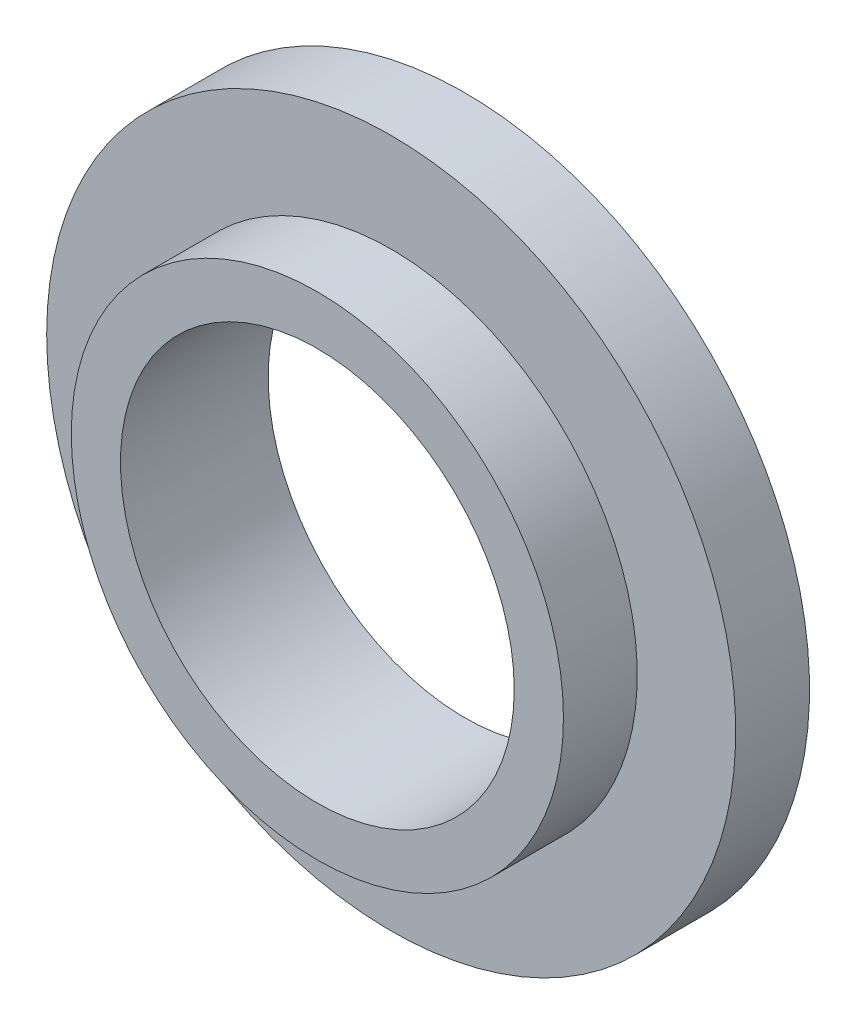
ISO-10303-21;
HEADER;
FILE_DESCRIPTION(('STEP AP214'),'2;1');
FILE_NAME('part.step','',(''),(''),'','','');
FILE_SCHEMA(('AUTOMOTIVE_DESIGN { 1 0 10303 214 1 1 1 1 }'));
ENDSEC;
DATA;
#1=APPLICATION_CONTEXT('core data for automotive mechanical design processes');
#2=APPLICATION_PROTOCOL_DEFINITION('international standard','automotive_design',2000,#1);
#3=PRODUCT_CONTEXT('',#1,'mechanical');
#4=PRODUCT('Part','Part','',(#3));
#5=PRODUCT_RELATED_PRODUCT_CATEGORY('part','',(#4));
#6=PRODUCT_DEFINITION_FORMATION('','',#4);
#7=PRODUCT_DEFINITION_CONTEXT('part definition',#1,'design');
#8=PRODUCT_DEFINITION('design','',#6,#7);
#9=PRODUCT_DEFINITION_SHAPE('','',#8);
#10=(LENGTH_UNIT() NAMED_UNIT(*) SI_UNIT(.MILLI.,.METRE.));
#11=(NAMED_UNIT(*) PLANE_ANGLE_UNIT() SI_UNIT($,.RADIAN.));
#12=(NAMED_UNIT(*) SI_UNIT($,.STERADIAN.) SOLID_ANGLE_UNIT());
#13=UNCERTAINTY_MEASURE_WITH_UNIT(LENGTH_MEASURE(1.E-05),#10,'distance_accuracy_value','');
#14=(GEOMETRIC_REPRESENTATION_CONTEXT(3) GLOBAL_UNCERTAINTY_ASSIGNED_CONTEXT((#13)) GLOBAL_UNIT_ASSIGNED_CONTEXT((#10,
#11,#12)) REPRESENTATION_CONTEXT('',''));
#15=CARTESIAN_POINT('',(0.,0.,0.));
#16=DIRECTION('',(0.,0.,1.));
#17=DIRECTION('',(1.,0.,0.));
#18=AXIS2_PLACEMENT_3D('',#15,#16,#17);
#19=CARTESIAN_POINT('',(0.,0.,15.));
#20=DIRECTION('',(0.,0.,-1.));
#21=DIRECTION('',(-1.,0.,0.));
#22=AXIS2_PLACEMENT_3D('',#19,#20,#21);
#23=CYLINDRICAL_SURFACE('',#22,25.);
#24=CARTESIAN_POINT('',(0.,0.,15.));
#25=DIRECTION('',(0.,0.,1.));
#26=DIRECTION('',(1.,0.,0.));
#27=AXIS2_PLACEMENT_3D('',#24,#25,#26);
#28=CIRCLE('',#27,25.);
#29=CARTESIAN_POINT('',(25.,0.,15.));
#30=VERTEX_POINT('',#29);
#31=EDGE_CURVE('E39',#30,#30,#28,.T.);
#32=ORIENTED_EDGE('',*,*,#31,.F.);
#33=EDGE_LOOP('',(#32));
#34=FACE_BOUND('',#33,.T.);
#35=CARTESIAN_POINT('',(0.,0.,7.5));
#36=DIRECTION('',(0.,0.,-1.));
#37=DIRECTION('',(-1.,0.,0.));
#38=AXIS2_PLACEMENT_3D('',#35,#36,#37);
#39=CIRCLE('',#38,25.);
#40=CARTESIAN_POINT('',(-25.,0.,7.5));
#41=VERTEX_POINT('',#40);
#42=EDGE_CURVE('E10',#41,#41,#39,.T.);
#43=ORIENTED_EDGE('',*,*,#42,.F.);
#44=EDGE_LOOP('',(#43));
#45=FACE_BOUND('',#44,.T.);
#46=ADVANCED_FACE('F33',(#34,#45),#23,.T.);
#47=CARTESIAN_POINT('',(0.,0.,15.));
#48=DIRECTION('',(0.,0.,1.));
#49=DIRECTION('',(1.,0.,0.));
#50=AXIS2_PLACEMENT_3D('',#47,#48,#49);
#51=PLANE('',#50);
#52=ORIENTED_EDGE('',*,*,#31,.T.);
#53=EDGE_LOOP('',(#52));
#54=FACE_BOUND('',#53,.T.);
#55=CARTESIAN_POINT('',(0.,0.,15.));
#56=DIRECTION('',(0.,0.,1.));
#57=DIRECTION('',(1.,0.,0.));
#58=AXIS2_PLACEMENT_3D('',#55,#56,#57);
#59=CIRCLE('',#58,20.);
#60=CARTESIAN_POINT('',(20.,0.,15.));
#61=VERTEX_POINT('',#60);
#62=EDGE_CURVE('E43',#61,#61,#59,.T.);
#63=ORIENTED_EDGE('',*,*,#62,.F.);
#64=EDGE_LOOP('',(#63));
#65=FACE_BOUND('',#64,.T.);
#66=ADVANCED_FACE('F71',(#54,#65),#51,.T.);
#67=CARTESIAN_POINT('',(0.,0.,0.));
#68=DIRECTION('',(0.,0.,1.));
#69=DIRECTION('',(1.,0.,0.));
#70=AXIS2_PLACEMENT_3D('',#67,#68,#69);
#71=PLANE('',#70);
#72=CARTESIAN_POINT('',(0.,0.,0.));
#73=DIRECTION('',(0.,0.,1.));
#74=DIRECTION('',(1.,0.,0.));
#75=AXIS2_PLACEMENT_3D('',#72,#73,#74);
#76=CIRCLE('',#75,20.);
#77=CARTESIAN_POINT('',(20.,0.,0.));
#78=VERTEX_POINT('',#77);
#79=EDGE_CURVE('E47',#78,#78,#76,.T.);
#80=ORIENTED_EDGE('',*,*,#79,.T.);
#81=EDGE_LOOP('',(#80));
#82=FACE_BOUND('',#81,.T.);
#83=CARTESIAN_POINT('',(0.,0.,0.));
#84=DIRECTION('',(0.,0.,-1.));
#85=DIRECTION('',(-1.,0.,0.));
#86=AXIS2_PLACEMENT_3D('',#83,#84,#85);
#87=CIRCLE('',#86,35.);
#88=CARTESIAN_POINT('',(-35.,0.,0.));
#89=VERTEX_POINT('',#88);
#90=EDGE_CURVE('E53',#89,#89,#87,.T.);
#91=ORIENTED_EDGE('',*,*,#90,.T.);
#92=EDGE_LOOP('',(#91));
#93=FACE_BOUND('',#92,.T.);
#94=ADVANCED_FACE('F76',(#82,#93),#71,.F.);
#95=CARTESIAN_POINT('',(0.,0.,15.));
#96=DIRECTION('',(0.,0.,-1.));
#97=DIRECTION('',(-1.,0.,0.));
#98=AXIS2_PLACEMENT_3D('',#95,#96,#97);
#99=CYLINDRICAL_SURFACE('',#98,20.);
#100=ORIENTED_EDGE('',*,*,#62,.T.);
#101=EDGE_LOOP('',(#100));
#102=FACE_BOUND('',#101,.T.);
#103=ORIENTED_EDGE('',*,*,#79,.F.);
#104=EDGE_LOOP('',(#103));
#105=FACE_BOUND('',#104,.T.);
#106=ADVANCED_FACE('F68',(#102,#105),#99,.F.);
#107=CARTESIAN_POINT('',(0.,0.,7.5));
#108=DIRECTION('',(0.,0.,-1.));
#109=DIRECTION('',(-1.,0.,0.));
#110=AXIS2_PLACEMENT_3D('',#107,#108,#109);
#111=CYLINDRICAL_SURFACE('',#110,35.);
#112=CARTESIAN_POINT('',(0.,0.,7.5));
#113=DIRECTION('',(0.,0.,-1.));
#114=DIRECTION('',(-1.,0.,0.));
#115=AXIS2_PLACEMENT_3D('',#112,#113,#114);
#116=CIRCLE('',#115,35.);
#117=CARTESIAN_POINT('',(-35.,0.,7.5));
#118=VERTEX_POINT('',#117);
#119=EDGE_CURVE('E51',#118,#118,#116,.T.);
#120=ORIENTED_EDGE('',*,*,#119,.T.);
#121=EDGE_LOOP('',(#120));
#122=FACE_BOUND('',#121,.T.);
#123=ORIENTED_EDGE('',*,*,#90,.F.);
#124=EDGE_LOOP('',(#123));
#125=FACE_BOUND('',#124,.T.);
#126=ADVANCED_FACE('F59',(#122,#125),#111,.T.);
#127=CARTESIAN_POINT('',(0.,0.,7.5));
#128=DIRECTION('',(0.,0.,-1.));
#129=DIRECTION('',(-1.,0.,0.));
#130=AXIS2_PLACEMENT_3D('',#127,#128,#129);
#131=PLANE('',#130);
#132=ORIENTED_EDGE('',*,*,#42,.T.);
#133=EDGE_LOOP('',(#132));
#134=FACE_BOUND('',#133,.T.);
#135=ORIENTED_EDGE('',*,*,#119,.F.);
#136=EDGE_LOOP('',(#135));
#137=FACE_BOUND('',#136,.T.);
#138=ADVANCED_FACE('F62',(#134,#137),#131,.F.);
#139=CLOSED_SHELL('',(#46,#66,#94,#106,#126,#138));
#140=MANIFOLD_SOLID_BREP('B2',#139);
#141=ADVANCED_BREP_SHAPE_REPRESENTATION('',(#18,#140),#14);
#142=SHAPE_DEFINITION_REPRESENTATION(#9,#141);
ENDSEC;
END-ISO-10303-21;
